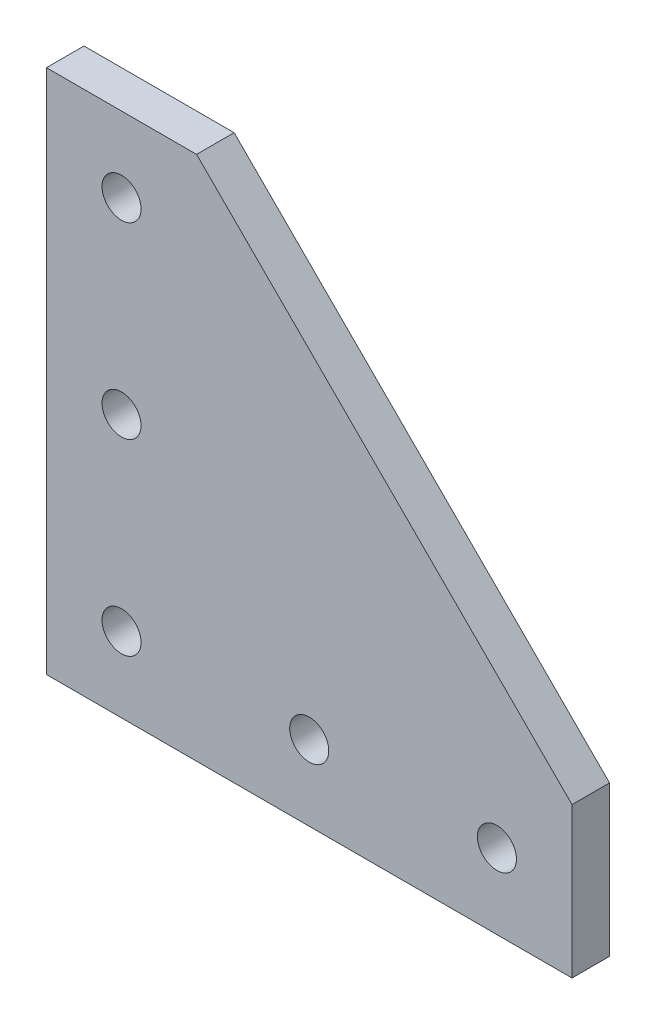
ISO-10303-21;
HEADER;
FILE_DESCRIPTION(('STEP AP214'),'2;1');
FILE_NAME('part.step','',(''),(''),'','','');
FILE_SCHEMA(('AUTOMOTIVE_DESIGN { 1 0 10303 214 1 1 1 1 }'));
ENDSEC;
DATA;
#1=APPLICATION_CONTEXT('core data for automotive mechanical design processes');
#2=APPLICATION_PROTOCOL_DEFINITION('international standard','automotive_design',2000,#1);
#3=PRODUCT_CONTEXT('',#1,'mechanical');
#4=PRODUCT('Part','Part','',(#3));
#5=PRODUCT_RELATED_PRODUCT_CATEGORY('part','',(#4));
#6=PRODUCT_DEFINITION_FORMATION('','',#4);
#7=PRODUCT_DEFINITION_CONTEXT('part definition',#1,'design');
#8=PRODUCT_DEFINITION('design','',#6,#7);
#9=PRODUCT_DEFINITION_SHAPE('','',#8);
#10=(LENGTH_UNIT() NAMED_UNIT(*) SI_UNIT(.MILLI.,.METRE.));
#11=(NAMED_UNIT(*) PLANE_ANGLE_UNIT() SI_UNIT($,.RADIAN.));
#12=(NAMED_UNIT(*) SI_UNIT($,.STERADIAN.) SOLID_ANGLE_UNIT());
#13=UNCERTAINTY_MEASURE_WITH_UNIT(LENGTH_MEASURE(1.E-05),#10,'distance_accuracy_value','');
#14=(GEOMETRIC_REPRESENTATION_CONTEXT(3) GLOBAL_UNCERTAINTY_ASSIGNED_CONTEXT((#13)) GLOBAL_UNIT_ASSIGNED_CONTEXT((#10,
#11,#12)) REPRESENTATION_CONTEXT('',''));
#15=CARTESIAN_POINT('',(0.,0.,0.));
#16=DIRECTION('',(0.,0.,1.));
#17=DIRECTION('',(1.,0.,0.));
#18=AXIS2_PLACEMENT_3D('',#15,#16,#17);
#19=CARTESIAN_POINT('',(0.,0.,6.35));
#20=DIRECTION('',(0.,-1.,0.));
#21=DIRECTION('',(1.,0.,0.));
#22=AXIS2_PLACEMENT_3D('',#19,#20,#21);
#23=PLANE('',#22);
#24=DIRECTION('',(-1.,0.,0.));
#25=VECTOR('',#24,1.);
#26=CARTESIAN_POINT('',(0.,0.,0.));
#27=LINE('',#26,#25);
#28=CARTESIAN_POINT('',(88.9,0.,0.));
#29=VERTEX_POINT('',#28);
#30=CARTESIAN_POINT('',(0.,0.,0.));
#31=VERTEX_POINT('',#30);
#32=EDGE_CURVE('E123',#29,#31,#27,.T.);
#33=ORIENTED_EDGE('',*,*,#32,.F.);
#34=DIRECTION('',(0.,0.,-1.));
#35=VECTOR('',#34,1.);
#36=CARTESIAN_POINT('',(88.9,0.,6.35));
#37=LINE('',#36,#35);
#38=CARTESIAN_POINT('',(88.9,0.,6.35));
#39=VERTEX_POINT('',#38);
#40=EDGE_CURVE('E11',#39,#29,#37,.T.);
#41=ORIENTED_EDGE('',*,*,#40,.F.);
#42=DIRECTION('',(-1.,0.,0.));
#43=VECTOR('',#42,1.);
#44=CARTESIAN_POINT('',(0.,0.,6.35));
#45=LINE('',#44,#43);
#46=CARTESIAN_POINT('',(0.,0.,6.35));
#47=VERTEX_POINT('',#46);
#48=EDGE_CURVE('E278',#39,#47,#45,.T.);
#49=ORIENTED_EDGE('',*,*,#48,.T.);
#50=DIRECTION('',(0.,0.,-1.));
#51=VECTOR('',#50,1.);
#52=CARTESIAN_POINT('',(0.,0.,6.35));
#53=LINE('',#52,#51);
#54=EDGE_CURVE('E51',#47,#31,#53,.T.);
#55=ORIENTED_EDGE('',*,*,#54,.T.);
#56=EDGE_LOOP('',(#33,#41,#49,#55));
#57=FACE_BOUND('',#56,.T.);
#58=ADVANCED_FACE('F34',(#57),#23,.T.);
#59=CARTESIAN_POINT('',(88.9,0.,6.35));
#60=DIRECTION('',(1.,0.,0.));
#61=DIRECTION('',(0.,0.,-1.));
#62=AXIS2_PLACEMENT_3D('',#59,#60,#61);
#63=PLANE('',#62);
#64=DIRECTION('',(0.,-1.,0.));
#65=VECTOR('',#64,1.);
#66=CARTESIAN_POINT('',(88.9,0.,0.));
#67=LINE('',#66,#65);
#68=CARTESIAN_POINT('',(88.9,25.4,0.));
#69=VERTEX_POINT('',#68);
#70=EDGE_CURVE('E125',#69,#29,#67,.T.);
#71=ORIENTED_EDGE('',*,*,#70,.F.);
#72=DIRECTION('',(0.,0.,-1.));
#73=VECTOR('',#72,1.);
#74=CARTESIAN_POINT('',(88.9,25.4,6.35));
#75=LINE('',#74,#73);
#76=CARTESIAN_POINT('',(88.9,25.4,6.35));
#77=VERTEX_POINT('',#76);
#78=EDGE_CURVE('E43',#77,#69,#75,.T.);
#79=ORIENTED_EDGE('',*,*,#78,.F.);
#80=DIRECTION('',(0.,-1.,0.));
#81=VECTOR('',#80,1.);
#82=CARTESIAN_POINT('',(88.9,0.,6.35));
#83=LINE('',#82,#81);
#84=EDGE_CURVE('E100',#77,#39,#83,.T.);
#85=ORIENTED_EDGE('',*,*,#84,.T.);
#86=ORIENTED_EDGE('',*,*,#40,.T.);
#87=EDGE_LOOP('',(#71,#79,#85,#86));
#88=FACE_BOUND('',#87,.T.);
#89=ADVANCED_FACE('F138',(#88),#63,.T.);
#90=CARTESIAN_POINT('',(57.15,57.15,6.35));
#91=DIRECTION('',(0.707106781186548,0.707106781186548,0.));
#92=DIRECTION('',(-0.707106781186548,0.707106781186548,0.));
#93=AXIS2_PLACEMENT_3D('',#90,#91,#92);
#94=PLANE('',#93);
#95=DIRECTION('',(0.707106781186548,-0.707106781186548,0.));
#96=VECTOR('',#95,1.);
#97=CARTESIAN_POINT('',(57.15,57.15,0.));
#98=LINE('',#97,#96);
#99=CARTESIAN_POINT('',(25.4,88.9,0.));
#100=VERTEX_POINT('',#99);
#101=EDGE_CURVE('E88',#100,#69,#98,.T.);
#102=ORIENTED_EDGE('',*,*,#101,.F.);
#103=DIRECTION('',(0.,0.,-1.));
#104=VECTOR('',#103,1.);
#105=CARTESIAN_POINT('',(25.4,88.9,6.35));
#106=LINE('',#105,#104);
#107=CARTESIAN_POINT('',(25.4,88.9,6.35));
#108=VERTEX_POINT('',#107);
#109=EDGE_CURVE('E83',#108,#100,#106,.T.);
#110=ORIENTED_EDGE('',*,*,#109,.F.);
#111=DIRECTION('',(0.707106781186548,-0.707106781186548,0.));
#112=VECTOR('',#111,1.);
#113=CARTESIAN_POINT('',(57.15,57.15,6.35));
#114=LINE('',#113,#112);
#115=EDGE_CURVE('E86',#108,#77,#114,.T.);
#116=ORIENTED_EDGE('',*,*,#115,.T.);
#117=ORIENTED_EDGE('',*,*,#78,.T.);
#118=EDGE_LOOP('',(#102,#110,#116,#117));
#119=FACE_BOUND('',#118,.T.);
#120=ADVANCED_FACE('F85',(#119),#94,.T.);
#121=CARTESIAN_POINT('',(0.,88.9,6.35));
#122=DIRECTION('',(0.,1.,0.));
#123=DIRECTION('',(0.,0.,1.));
#124=AXIS2_PLACEMENT_3D('',#121,#122,#123);
#125=PLANE('',#124);
#126=DIRECTION('',(1.,0.,0.));
#127=VECTOR('',#126,1.);
#128=CARTESIAN_POINT('',(0.,88.9,0.));
#129=LINE('',#128,#127);
#130=CARTESIAN_POINT('',(0.,88.9,0.));
#131=VERTEX_POINT('',#130);
#132=EDGE_CURVE('E129',#131,#100,#129,.T.);
#133=ORIENTED_EDGE('',*,*,#132,.F.);
#134=DIRECTION('',(0.,0.,-1.));
#135=VECTOR('',#134,1.);
#136=CARTESIAN_POINT('',(0.,88.9,6.35));
#137=LINE('',#136,#135);
#138=CARTESIAN_POINT('',(0.,88.9,6.35));
#139=VERTEX_POINT('',#138);
#140=EDGE_CURVE('E67',#139,#131,#137,.T.);
#141=ORIENTED_EDGE('',*,*,#140,.F.);
#142=DIRECTION('',(1.,0.,0.));
#143=VECTOR('',#142,1.);
#144=CARTESIAN_POINT('',(0.,88.9,6.35));
#145=LINE('',#144,#143);
#146=EDGE_CURVE('E98',#139,#108,#145,.T.);
#147=ORIENTED_EDGE('',*,*,#146,.T.);
#148=ORIENTED_EDGE('',*,*,#109,.T.);
#149=EDGE_LOOP('',(#133,#141,#147,#148));
#150=FACE_BOUND('',#149,.T.);
#151=ADVANCED_FACE('F102',(#150),#125,.T.);
#152=CARTESIAN_POINT('',(12.7,12.7,6.35));
#153=DIRECTION('',(0.,0.,-1.));
#154=DIRECTION('',(-1.,0.,0.));
#155=AXIS2_PLACEMENT_3D('',#152,#153,#154);
#156=CYLINDRICAL_SURFACE('',#155,3.302);
#157=CARTESIAN_POINT('',(12.7,12.7,6.35));
#158=DIRECTION('',(0.,0.,1.));
#159=DIRECTION('',(1.,0.,0.));
#160=AXIS2_PLACEMENT_3D('',#157,#158,#159);
#161=CIRCLE('',#160,3.302);
#162=CARTESIAN_POINT('',(16.002,12.7,6.35));
#163=VERTEX_POINT('',#162);
#164=EDGE_CURVE('E275',#163,#163,#161,.T.);
#165=ORIENTED_EDGE('',*,*,#164,.T.);
#166=EDGE_LOOP('',(#165));
#167=FACE_BOUND('',#166,.T.);
#168=CARTESIAN_POINT('',(12.7,12.7,0.));
#169=DIRECTION('',(0.,0.,1.));
#170=DIRECTION('',(1.,0.,0.));
#171=AXIS2_PLACEMENT_3D('',#168,#169,#170);
#172=CIRCLE('',#171,3.302);
#173=CARTESIAN_POINT('',(16.002,12.7,0.));
#174=VERTEX_POINT('',#173);
#175=EDGE_CURVE('E120',#174,#174,#172,.T.);
#176=ORIENTED_EDGE('',*,*,#175,.F.);
#177=EDGE_LOOP('',(#176));
#178=FACE_BOUND('',#177,.T.);
#179=ADVANCED_FACE('F162',(#167,#178),#156,.F.);
#180=CARTESIAN_POINT('',(12.7,44.45,6.35));
#181=DIRECTION('',(0.,0.,-1.));
#182=DIRECTION('',(-1.,0.,0.));
#183=AXIS2_PLACEMENT_3D('',#180,#181,#182);
#184=CYLINDRICAL_SURFACE('',#183,3.302);
#185=CARTESIAN_POINT('',(12.7,44.45,6.35));
#186=DIRECTION('',(0.,0.,1.));
#187=DIRECTION('',(1.,0.,0.));
#188=AXIS2_PLACEMENT_3D('',#185,#186,#187);
#189=CIRCLE('',#188,3.302);
#190=CARTESIAN_POINT('',(16.002,44.45,6.35));
#191=VERTEX_POINT('',#190);
#192=EDGE_CURVE('E268',#191,#191,#189,.T.);
#193=ORIENTED_EDGE('',*,*,#192,.T.);
#194=EDGE_LOOP('',(#193));
#195=FACE_BOUND('',#194,.T.);
#196=CARTESIAN_POINT('',(12.7,44.45,0.));
#197=DIRECTION('',(0.,0.,1.));
#198=DIRECTION('',(1.,0.,0.));
#199=AXIS2_PLACEMENT_3D('',#196,#197,#198);
#200=CIRCLE('',#199,3.302);
#201=CARTESIAN_POINT('',(16.002,44.45,0.));
#202=VERTEX_POINT('',#201);
#203=EDGE_CURVE('E117',#202,#202,#200,.T.);
#204=ORIENTED_EDGE('',*,*,#203,.F.);
#205=EDGE_LOOP('',(#204));
#206=FACE_BOUND('',#205,.T.);
#207=ADVANCED_FACE('F165',(#195,#206),#184,.F.);
#208=CARTESIAN_POINT('',(12.7,76.1999999999999,6.35));
#209=DIRECTION('',(0.,0.,-1.));
#210=DIRECTION('',(-1.,0.,0.));
#211=AXIS2_PLACEMENT_3D('',#208,#209,#210);
#212=CYLINDRICAL_SURFACE('',#211,3.302);
#213=CARTESIAN_POINT('',(12.7,76.1999999999999,6.35));
#214=DIRECTION('',(0.,0.,1.));
#215=DIRECTION('',(1.,0.,0.));
#216=AXIS2_PLACEMENT_3D('',#213,#214,#215);
#217=CIRCLE('',#216,3.302);
#218=CARTESIAN_POINT('',(16.002,76.1999999999999,6.35));
#219=VERTEX_POINT('',#218);
#220=EDGE_CURVE('E265',#219,#219,#217,.T.);
#221=ORIENTED_EDGE('',*,*,#220,.T.);
#222=EDGE_LOOP('',(#221));
#223=FACE_BOUND('',#222,.T.);
#224=CARTESIAN_POINT('',(12.7,76.1999999999999,0.));
#225=DIRECTION('',(0.,0.,1.));
#226=DIRECTION('',(1.,0.,0.));
#227=AXIS2_PLACEMENT_3D('',#224,#225,#226);
#228=CIRCLE('',#227,3.302);
#229=CARTESIAN_POINT('',(16.002,76.1999999999999,0.));
#230=VERTEX_POINT('',#229);
#231=EDGE_CURVE('E114',#230,#230,#228,.T.);
#232=ORIENTED_EDGE('',*,*,#231,.F.);
#233=EDGE_LOOP('',(#232));
#234=FACE_BOUND('',#233,.T.);
#235=ADVANCED_FACE('F169',(#223,#234),#212,.F.);
#236=CARTESIAN_POINT('',(44.45,12.7,6.35));
#237=DIRECTION('',(0.,0.,-1.));
#238=DIRECTION('',(-1.,0.,0.));
#239=AXIS2_PLACEMENT_3D('',#236,#237,#238);
#240=CYLINDRICAL_SURFACE('',#239,3.302);
#241=CARTESIAN_POINT('',(44.45,12.7,6.35));
#242=DIRECTION('',(0.,0.,1.));
#243=DIRECTION('',(1.,0.,0.));
#244=AXIS2_PLACEMENT_3D('',#241,#242,#243);
#245=CIRCLE('',#244,3.302);
#246=CARTESIAN_POINT('',(47.752,12.7,6.35));
#247=VERTEX_POINT('',#246);
#248=EDGE_CURVE('E180',#247,#247,#245,.T.);
#249=ORIENTED_EDGE('',*,*,#248,.T.);
#250=EDGE_LOOP('',(#249));
#251=FACE_BOUND('',#250,.T.);
#252=CARTESIAN_POINT('',(44.45,12.7,0.));
#253=DIRECTION('',(0.,0.,1.));
#254=DIRECTION('',(1.,0.,0.));
#255=AXIS2_PLACEMENT_3D('',#252,#253,#254);
#256=CIRCLE('',#255,3.302);
#257=CARTESIAN_POINT('',(47.752,12.7,0.));
#258=VERTEX_POINT('',#257);
#259=EDGE_CURVE('E111',#258,#258,#256,.T.);
#260=ORIENTED_EDGE('',*,*,#259,.F.);
#261=EDGE_LOOP('',(#260));
#262=FACE_BOUND('',#261,.T.);
#263=ADVANCED_FACE('F150',(#251,#262),#240,.F.);
#264=CARTESIAN_POINT('',(76.2,12.7,6.35));
#265=DIRECTION('',(0.,0.,-1.));
#266=DIRECTION('',(-1.,0.,0.));
#267=AXIS2_PLACEMENT_3D('',#264,#265,#266);
#268=CYLINDRICAL_SURFACE('',#267,3.302);
#269=CARTESIAN_POINT('',(76.2,12.7,6.35));
#270=DIRECTION('',(0.,0.,1.));
#271=DIRECTION('',(1.,0.,0.));
#272=AXIS2_PLACEMENT_3D('',#269,#270,#271);
#273=CIRCLE('',#272,3.302);
#274=CARTESIAN_POINT('',(79.502,12.7,6.35));
#275=VERTEX_POINT('',#274);
#276=EDGE_CURVE('E134',#275,#275,#273,.T.);
#277=ORIENTED_EDGE('',*,*,#276,.T.);
#278=EDGE_LOOP('',(#277));
#279=FACE_BOUND('',#278,.T.);
#280=CARTESIAN_POINT('',(76.2,12.7,0.));
#281=DIRECTION('',(0.,0.,1.));
#282=DIRECTION('',(1.,0.,0.));
#283=AXIS2_PLACEMENT_3D('',#280,#281,#282);
#284=CIRCLE('',#283,3.302);
#285=CARTESIAN_POINT('',(79.502,12.7,0.));
#286=VERTEX_POINT('',#285);
#287=EDGE_CURVE('E108',#286,#286,#284,.T.);
#288=ORIENTED_EDGE('',*,*,#287,.F.);
#289=EDGE_LOOP('',(#288));
#290=FACE_BOUND('',#289,.T.);
#291=ADVANCED_FACE('F36',(#279,#290),#268,.F.);
#292=CARTESIAN_POINT('',(0.,0.,6.35));
#293=DIRECTION('',(-1.,0.,0.));
#294=DIRECTION('',(0.,0.,1.));
#295=AXIS2_PLACEMENT_3D('',#292,#293,#294);
#296=PLANE('',#295);
#297=DIRECTION('',(0.,1.,0.));
#298=VECTOR('',#297,1.);
#299=CARTESIAN_POINT('',(0.,0.,0.));
#300=LINE('',#299,#298);
#301=EDGE_CURVE('E131',#31,#131,#300,.T.);
#302=ORIENTED_EDGE('',*,*,#301,.F.);
#303=ORIENTED_EDGE('',*,*,#54,.F.);
#304=DIRECTION('',(0.,1.,0.));
#305=VECTOR('',#304,1.);
#306=CARTESIAN_POINT('',(0.,0.,6.35));
#307=LINE('',#306,#305);
#308=EDGE_CURVE('E103',#47,#139,#307,.T.);
#309=ORIENTED_EDGE('',*,*,#308,.T.);
#310=ORIENTED_EDGE('',*,*,#140,.T.);
#311=EDGE_LOOP('',(#302,#303,#309,#310));
#312=FACE_BOUND('',#311,.T.);
#313=ADVANCED_FACE('F141',(#312),#296,.T.);
#314=CARTESIAN_POINT('',(0.,0.,6.35));
#315=DIRECTION('',(0.,0.,1.));
#316=DIRECTION('',(1.,0.,0.));
#317=AXIS2_PLACEMENT_3D('',#314,#315,#316);
#318=PLANE('',#317);
#319=ORIENTED_EDGE('',*,*,#276,.F.);
#320=EDGE_LOOP('',(#319));
#321=FACE_BOUND('',#320,.T.);
#322=ORIENTED_EDGE('',*,*,#248,.F.);
#323=EDGE_LOOP('',(#322));
#324=FACE_BOUND('',#323,.T.);
#325=ORIENTED_EDGE('',*,*,#220,.F.);
#326=EDGE_LOOP('',(#325));
#327=FACE_BOUND('',#326,.T.);
#328=ORIENTED_EDGE('',*,*,#192,.F.);
#329=EDGE_LOOP('',(#328));
#330=FACE_BOUND('',#329,.T.);
#331=ORIENTED_EDGE('',*,*,#164,.F.);
#332=EDGE_LOOP('',(#331));
#333=FACE_BOUND('',#332,.T.);
#334=ORIENTED_EDGE('',*,*,#48,.F.);
#335=ORIENTED_EDGE('',*,*,#84,.F.);
#336=ORIENTED_EDGE('',*,*,#115,.F.);
#337=ORIENTED_EDGE('',*,*,#146,.F.);
#338=ORIENTED_EDGE('',*,*,#308,.F.);
#339=EDGE_LOOP('',(#334,#335,#336,#337,#338));
#340=FACE_BOUND('',#339,.T.);
#341=ADVANCED_FACE('F96',(#321,#324,#327,#330,#333,#340),#318,.T.);
#342=CARTESIAN_POINT('',(0.,0.,0.));
#343=DIRECTION('',(0.,0.,1.));
#344=DIRECTION('',(1.,0.,0.));
#345=AXIS2_PLACEMENT_3D('',#342,#343,#344);
#346=PLANE('',#345);
#347=ORIENTED_EDGE('',*,*,#287,.T.);
#348=EDGE_LOOP('',(#347));
#349=FACE_BOUND('',#348,.T.);
#350=ORIENTED_EDGE('',*,*,#259,.T.);
#351=EDGE_LOOP('',(#350));
#352=FACE_BOUND('',#351,.T.);
#353=ORIENTED_EDGE('',*,*,#231,.T.);
#354=EDGE_LOOP('',(#353));
#355=FACE_BOUND('',#354,.T.);
#356=ORIENTED_EDGE('',*,*,#203,.T.);
#357=EDGE_LOOP('',(#356));
#358=FACE_BOUND('',#357,.T.);
#359=ORIENTED_EDGE('',*,*,#175,.T.);
#360=EDGE_LOOP('',(#359));
#361=FACE_BOUND('',#360,.T.);
#362=ORIENTED_EDGE('',*,*,#32,.T.);
#363=ORIENTED_EDGE('',*,*,#301,.T.);
#364=ORIENTED_EDGE('',*,*,#132,.T.);
#365=ORIENTED_EDGE('',*,*,#101,.T.);
#366=ORIENTED_EDGE('',*,*,#70,.T.);
#367=EDGE_LOOP('',(#362,#363,#364,#365,#366));
#368=FACE_BOUND('',#367,.T.);
#369=ADVANCED_FACE('F140',(#349,#352,#355,#358,#361,#368),#346,.F.);
#370=CLOSED_SHELL('',(#58,#89,#120,#151,#179,#207,#235,#263,#291,#313,#341,#369));
#371=MANIFOLD_SOLID_BREP('B2',#370);
#372=ADVANCED_BREP_SHAPE_REPRESENTATION('',(#18,#371),#14);
#373=SHAPE_DEFINITION_REPRESENTATION(#9,#372);
ENDSEC;
END-ISO-10303-21;
